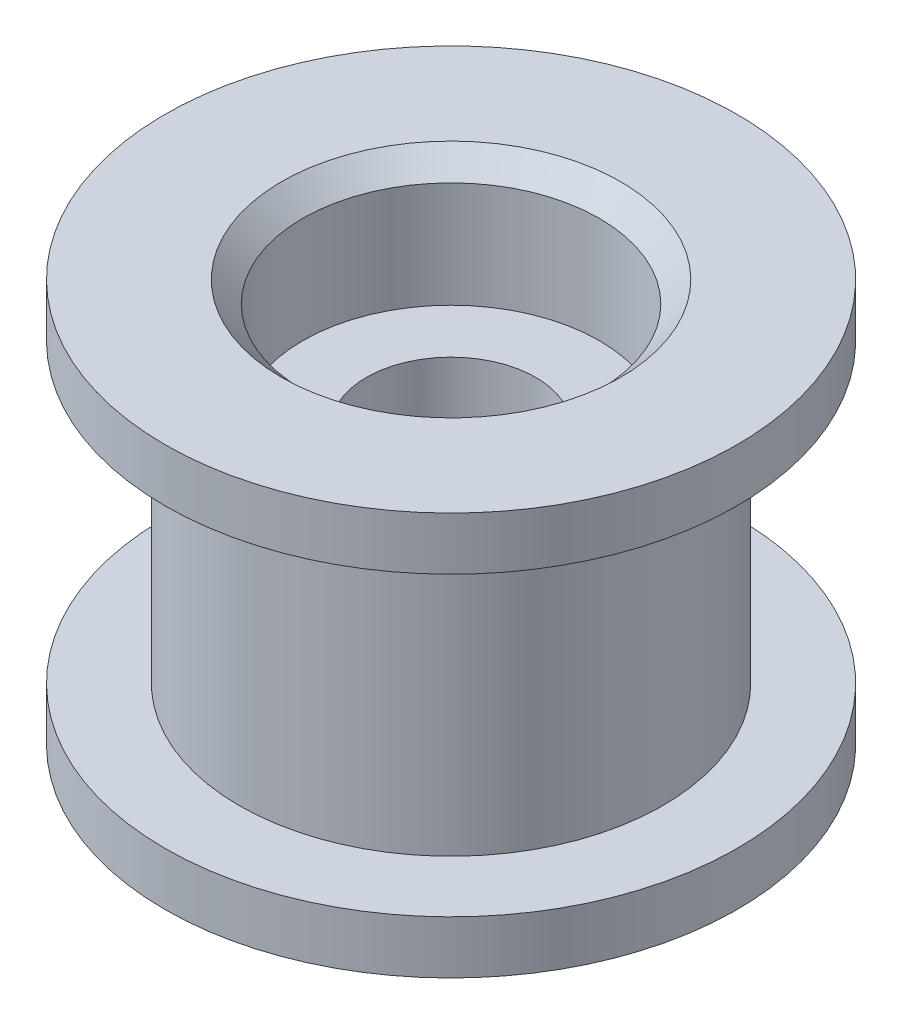
ISO-10303-21;
HEADER;
FILE_DESCRIPTION(('STEP AP214'),'2;1');
FILE_NAME('part.step','',(''),(''),'','','');
FILE_SCHEMA(('AUTOMOTIVE_DESIGN { 1 0 10303 214 1 1 1 1 }'));
ENDSEC;
DATA;
#1=APPLICATION_CONTEXT('core data for automotive mechanical design processes');
#2=APPLICATION_PROTOCOL_DEFINITION('international standard','automotive_design',2000,#1);
#3=PRODUCT_CONTEXT('',#1,'mechanical');
#4=PRODUCT('Part','Part','',(#3));
#5=PRODUCT_RELATED_PRODUCT_CATEGORY('part','',(#4));
#6=PRODUCT_DEFINITION_FORMATION('','',#4);
#7=PRODUCT_DEFINITION_CONTEXT('part definition',#1,'design');
#8=PRODUCT_DEFINITION('design','',#6,#7);
#9=PRODUCT_DEFINITION_SHAPE('','',#8);
#10=(LENGTH_UNIT() NAMED_UNIT(*) SI_UNIT(.MILLI.,.METRE.));
#11=(NAMED_UNIT(*) PLANE_ANGLE_UNIT() SI_UNIT($,.RADIAN.));
#12=(NAMED_UNIT(*) SI_UNIT($,.STERADIAN.) SOLID_ANGLE_UNIT());
#13=UNCERTAINTY_MEASURE_WITH_UNIT(LENGTH_MEASURE(1.E-05),#10,'distance_accuracy_value','');
#14=(GEOMETRIC_REPRESENTATION_CONTEXT(3) GLOBAL_UNCERTAINTY_ASSIGNED_CONTEXT((#13)) GLOBAL_UNIT_ASSIGNED_CONTEXT((#10,
#11,#12)) REPRESENTATION_CONTEXT('',''));
#15=CARTESIAN_POINT('',(0.,0.,0.));
#16=DIRECTION('',(0.,0.,1.));
#17=DIRECTION('',(1.,0.,0.));
#18=AXIS2_PLACEMENT_3D('',#15,#16,#17);
#19=CARTESIAN_POINT('',(0.,7.,0.));
#20=DIRECTION('',(0.,-1.,0.));
#21=DIRECTION('',(0.,0.,-1.));
#22=AXIS2_PLACEMENT_3D('',#19,#20,#21);
#23=CYLINDRICAL_SURFACE('',#22,5.);
#24=CARTESIAN_POINT('',(0.,7.,0.));
#25=DIRECTION('',(0.,1.,0.));
#26=DIRECTION('',(0.,0.,1.));
#27=AXIS2_PLACEMENT_3D('',#24,#25,#26);
#28=CIRCLE('',#27,5.);
#29=CARTESIAN_POINT('',(0.,7.,5.));
#30=VERTEX_POINT('',#29);
#31=EDGE_CURVE('E56',#30,#30,#28,.T.);
#32=ORIENTED_EDGE('',*,*,#31,.F.);
#33=EDGE_LOOP('',(#32));
#34=FACE_BOUND('',#33,.T.);
#35=CARTESIAN_POINT('',(0.,0.,0.));
#36=DIRECTION('',(0.,1.,0.));
#37=DIRECTION('',(0.,0.,1.));
#38=AXIS2_PLACEMENT_3D('',#35,#36,#37);
#39=CIRCLE('',#38,5.);
#40=CARTESIAN_POINT('',(0.,0.,5.));
#41=VERTEX_POINT('',#40);
#42=EDGE_CURVE('E62',#41,#41,#39,.T.);
#43=ORIENTED_EDGE('',*,*,#42,.T.);
#44=EDGE_LOOP('',(#43));
#45=FACE_BOUND('',#44,.T.);
#46=ADVANCED_FACE('F35',(#34,#45),#23,.T.);
#47=CARTESIAN_POINT('',(0.,8.25,0.));
#48=DIRECTION('',(0.,-1.,0.));
#49=DIRECTION('',(0.,0.,-1.));
#50=AXIS2_PLACEMENT_3D('',#47,#48,#49);
#51=CYLINDRICAL_SURFACE('',#50,6.75);
#52=CARTESIAN_POINT('',(0.,8.25,0.));
#53=DIRECTION('',(0.,1.,0.));
#54=DIRECTION('',(0.,0.,1.));
#55=AXIS2_PLACEMENT_3D('',#52,#53,#54);
#56=CIRCLE('',#55,6.75);
#57=CARTESIAN_POINT('',(0.,8.25,6.75));
#58=VERTEX_POINT('',#57);
#59=EDGE_CURVE('E69',#58,#58,#56,.T.);
#60=ORIENTED_EDGE('',*,*,#59,.F.);
#61=EDGE_LOOP('',(#60));
#62=FACE_BOUND('',#61,.T.);
#63=CARTESIAN_POINT('',(0.,7.,0.));
#64=DIRECTION('',(0.,1.,0.));
#65=DIRECTION('',(0.,0.,1.));
#66=AXIS2_PLACEMENT_3D('',#63,#64,#65);
#67=CIRCLE('',#66,6.75);
#68=CARTESIAN_POINT('',(0.,7.,6.75));
#69=VERTEX_POINT('',#68);
#70=EDGE_CURVE('E65',#69,#69,#67,.T.);
#71=ORIENTED_EDGE('',*,*,#70,.T.);
#72=EDGE_LOOP('',(#71));
#73=FACE_BOUND('',#72,.T.);
#74=ADVANCED_FACE('F107',(#62,#73),#51,.T.);
#75=CARTESIAN_POINT('',(0.,8.25,0.));
#76=DIRECTION('',(0.,1.,0.));
#77=DIRECTION('',(0.,0.,1.));
#78=AXIS2_PLACEMENT_3D('',#75,#76,#77);
#79=PLANE('',#78);
#80=CARTESIAN_POINT('',(0.,8.25,0.));
#81=DIRECTION('',(0.,1.,0.));
#82=DIRECTION('',(0.,0.,1.));
#83=AXIS2_PLACEMENT_3D('',#80,#81,#82);
#84=CIRCLE('',#83,4.);
#85=CARTESIAN_POINT('',(0.,8.25,4.));
#86=VERTEX_POINT('',#85);
#87=EDGE_CURVE('E47',#86,#86,#84,.F.);
#88=ORIENTED_EDGE('',*,*,#87,.T.);
#89=EDGE_LOOP('',(#88));
#90=FACE_BOUND('',#89,.T.);
#91=ORIENTED_EDGE('',*,*,#59,.T.);
#92=EDGE_LOOP('',(#91));
#93=FACE_BOUND('',#92,.T.);
#94=ADVANCED_FACE('F113',(#90,#93),#79,.T.);
#95=CARTESIAN_POINT('',(0.,7.,0.));
#96=DIRECTION('',(0.,1.,0.));
#97=DIRECTION('',(0.,0.,1.));
#98=AXIS2_PLACEMENT_3D('',#95,#96,#97);
#99=PLANE('',#98);
#100=ORIENTED_EDGE('',*,*,#31,.T.);
#101=EDGE_LOOP('',(#100));
#102=FACE_BOUND('',#101,.T.);
#103=ORIENTED_EDGE('',*,*,#70,.F.);
#104=EDGE_LOOP('',(#103));
#105=FACE_BOUND('',#104,.T.);
#106=ADVANCED_FACE('F138',(#102,#105),#99,.F.);
#107=CARTESIAN_POINT('',(0.,-1.25,0.));
#108=DIRECTION('',(0.,1.,0.));
#109=DIRECTION('',(0.,0.,1.));
#110=AXIS2_PLACEMENT_3D('',#107,#108,#109);
#111=CYLINDRICAL_SURFACE('',#110,6.75);
#112=CARTESIAN_POINT('',(0.,-1.25,0.));
#113=DIRECTION('',(0.,1.,0.));
#114=DIRECTION('',(0.,0.,1.));
#115=AXIS2_PLACEMENT_3D('',#112,#113,#114);
#116=CIRCLE('',#115,6.75);
#117=CARTESIAN_POINT('',(0.,-1.25,6.75));
#118=VERTEX_POINT('',#117);
#119=EDGE_CURVE('E66',#118,#118,#116,.T.);
#120=ORIENTED_EDGE('',*,*,#119,.T.);
#121=EDGE_LOOP('',(#120));
#122=FACE_BOUND('',#121,.T.);
#123=CARTESIAN_POINT('',(0.,0.,0.));
#124=DIRECTION('',(0.,1.,0.));
#125=DIRECTION('',(0.,0.,1.));
#126=AXIS2_PLACEMENT_3D('',#123,#124,#125);
#127=CIRCLE('',#126,6.75);
#128=CARTESIAN_POINT('',(0.,0.,6.75));
#129=VERTEX_POINT('',#128);
#130=EDGE_CURVE('E74',#129,#129,#127,.T.);
#131=ORIENTED_EDGE('',*,*,#130,.F.);
#132=EDGE_LOOP('',(#131));
#133=FACE_BOUND('',#132,.T.);
#134=ADVANCED_FACE('F145',(#122,#133),#111,.T.);
#135=CARTESIAN_POINT('',(0.,-1.25,0.));
#136=DIRECTION('',(0.,1.,0.));
#137=DIRECTION('',(0.,0.,1.));
#138=AXIS2_PLACEMENT_3D('',#135,#136,#137);
#139=PLANE('',#138);
#140=CARTESIAN_POINT('',(0.,-1.25,0.));
#141=DIRECTION('',(0.,1.,0.));
#142=DIRECTION('',(0.,0.,1.));
#143=AXIS2_PLACEMENT_3D('',#140,#141,#142);
#144=CIRCLE('',#143,4.);
#145=CARTESIAN_POINT('',(0.,-1.25,4.));
#146=VERTEX_POINT('',#145);
#147=EDGE_CURVE('E10',#146,#146,#144,.T.);
#148=ORIENTED_EDGE('',*,*,#147,.T.);
#149=EDGE_LOOP('',(#148));
#150=FACE_BOUND('',#149,.T.);
#151=ORIENTED_EDGE('',*,*,#119,.F.);
#152=EDGE_LOOP('',(#151));
#153=FACE_BOUND('',#152,.T.);
#154=ADVANCED_FACE('F150',(#150,#153),#139,.F.);
#155=CARTESIAN_POINT('',(0.,0.,0.));
#156=DIRECTION('',(0.,1.,0.));
#157=DIRECTION('',(0.,0.,1.));
#158=AXIS2_PLACEMENT_3D('',#155,#156,#157);
#159=PLANE('',#158);
#160=ORIENTED_EDGE('',*,*,#42,.F.);
#161=EDGE_LOOP('',(#160));
#162=FACE_BOUND('',#161,.T.);
#163=ORIENTED_EDGE('',*,*,#130,.T.);
#164=EDGE_LOOP('',(#163));
#165=FACE_BOUND('',#164,.T.);
#166=ADVANCED_FACE('F154',(#162,#165),#159,.T.);
#167=CARTESIAN_POINT('',(0.,1.75,0.));
#168=DIRECTION('',(0.,-1.,0.));
#169=DIRECTION('',(0.,0.,-1.));
#170=AXIS2_PLACEMENT_3D('',#167,#168,#169);
#171=CYLINDRICAL_SURFACE('',#170,3.5);
#172=CARTESIAN_POINT('',(0.,-0.750000000000002,0.));
#173=DIRECTION('',(0.,1.,0.));
#174=DIRECTION('',(0.,0.,1.));
#175=AXIS2_PLACEMENT_3D('',#172,#173,#174);
#176=CIRCLE('',#175,3.5);
#177=CARTESIAN_POINT('',(0.,-0.750000000000002,3.5));
#178=VERTEX_POINT('',#177);
#179=EDGE_CURVE('E43',#178,#178,#176,.F.);
#180=ORIENTED_EDGE('',*,*,#179,.T.);
#181=EDGE_LOOP('',(#180));
#182=FACE_BOUND('',#181,.T.);
#183=CARTESIAN_POINT('',(0.,1.75,0.));
#184=DIRECTION('',(0.,-1.,0.));
#185=DIRECTION('',(0.,0.,-1.));
#186=AXIS2_PLACEMENT_3D('',#183,#184,#185);
#187=CIRCLE('',#186,3.5);
#188=CARTESIAN_POINT('',(0.,1.75,-3.5));
#189=VERTEX_POINT('',#188);
#190=EDGE_CURVE('E77',#189,#189,#187,.T.);
#191=ORIENTED_EDGE('',*,*,#190,.F.);
#192=EDGE_LOOP('',(#191));
#193=FACE_BOUND('',#192,.T.);
#194=ADVANCED_FACE('F103',(#182,#193),#171,.F.);
#195=CARTESIAN_POINT('',(0.,1.75,0.));
#196=DIRECTION('',(0.,-1.,0.));
#197=DIRECTION('',(0.,0.,-1.));
#198=AXIS2_PLACEMENT_3D('',#195,#196,#197);
#199=PLANE('',#198);
#200=CARTESIAN_POINT('',(0.,1.75,0.));
#201=DIRECTION('',(0.,-1.,0.));
#202=DIRECTION('',(0.,0.,-1.));
#203=AXIS2_PLACEMENT_3D('',#200,#201,#202);
#204=CIRCLE('',#203,2.);
#205=CARTESIAN_POINT('',(0.,1.75,-2.));
#206=VERTEX_POINT('',#205);
#207=EDGE_CURVE('E57',#206,#206,#204,.T.);
#208=ORIENTED_EDGE('',*,*,#207,.F.);
#209=EDGE_LOOP('',(#208));
#210=FACE_BOUND('',#209,.T.);
#211=ORIENTED_EDGE('',*,*,#190,.T.);
#212=EDGE_LOOP('',(#211));
#213=FACE_BOUND('',#212,.T.);
#214=ADVANCED_FACE('F97',(#210,#213),#199,.T.);
#215=CARTESIAN_POINT('',(0.,5.25,0.));
#216=DIRECTION('',(0.,1.,0.));
#217=DIRECTION('',(0.,0.,1.));
#218=AXIS2_PLACEMENT_3D('',#215,#216,#217);
#219=CYLINDRICAL_SURFACE('',#218,3.5);
#220=CARTESIAN_POINT('',(0.,7.75,0.));
#221=DIRECTION('',(0.,1.,0.));
#222=DIRECTION('',(0.,0.,1.));
#223=AXIS2_PLACEMENT_3D('',#220,#221,#222);
#224=CIRCLE('',#223,3.5);
#225=CARTESIAN_POINT('',(0.,7.75,3.5));
#226=VERTEX_POINT('',#225);
#227=EDGE_CURVE('E51',#226,#226,#224,.T.);
#228=ORIENTED_EDGE('',*,*,#227,.T.);
#229=EDGE_LOOP('',(#228));
#230=FACE_BOUND('',#229,.T.);
#231=CARTESIAN_POINT('',(0.,5.25,0.));
#232=DIRECTION('',(0.,1.,0.));
#233=DIRECTION('',(0.,0.,1.));
#234=AXIS2_PLACEMENT_3D('',#231,#232,#233);
#235=CIRCLE('',#234,3.5);
#236=CARTESIAN_POINT('',(0.,5.25,3.5));
#237=VERTEX_POINT('',#236);
#238=EDGE_CURVE('E60',#237,#237,#235,.T.);
#239=ORIENTED_EDGE('',*,*,#238,.F.);
#240=EDGE_LOOP('',(#239));
#241=FACE_BOUND('',#240,.T.);
#242=ADVANCED_FACE('F92',(#230,#241),#219,.F.);
#243=CARTESIAN_POINT('',(0.,5.25,0.));
#244=DIRECTION('',(0.,1.,0.));
#245=DIRECTION('',(0.,0.,1.));
#246=AXIS2_PLACEMENT_3D('',#243,#244,#245);
#247=PLANE('',#246);
#248=CARTESIAN_POINT('',(0.,5.25,0.));
#249=DIRECTION('',(0.,1.,0.));
#250=DIRECTION('',(0.,0.,1.));
#251=AXIS2_PLACEMENT_3D('',#248,#249,#250);
#252=CIRCLE('',#251,2.);
#253=CARTESIAN_POINT('',(0.,5.25,2.));
#254=VERTEX_POINT('',#253);
#255=EDGE_CURVE('E61',#254,#254,#252,.T.);
#256=ORIENTED_EDGE('',*,*,#255,.F.);
#257=EDGE_LOOP('',(#256));
#258=FACE_BOUND('',#257,.T.);
#259=ORIENTED_EDGE('',*,*,#238,.T.);
#260=EDGE_LOOP('',(#259));
#261=FACE_BOUND('',#260,.T.);
#262=ADVANCED_FACE('F89',(#258,#261),#247,.T.);
#263=CARTESIAN_POINT('',(0.,-1.25,0.));
#264=DIRECTION('',(0.,1.,0.));
#265=DIRECTION('',(0.,0.,1.));
#266=AXIS2_PLACEMENT_3D('',#263,#264,#265);
#267=CYLINDRICAL_SURFACE('',#266,2.);
#268=ORIENTED_EDGE('',*,*,#207,.T.);
#269=EDGE_LOOP('',(#268));
#270=FACE_BOUND('',#269,.T.);
#271=ORIENTED_EDGE('',*,*,#255,.T.);
#272=EDGE_LOOP('',(#271));
#273=FACE_BOUND('',#272,.T.);
#274=ADVANCED_FACE('F87',(#270,#273),#267,.F.);
#275=CARTESIAN_POINT('',(0.,7.75,0.));
#276=DIRECTION('',(0.,1.,0.));
#277=DIRECTION('',(0.,0.,1.));
#278=AXIS2_PLACEMENT_3D('',#275,#276,#277);
#279=CONICAL_SURFACE('',#278,3.5,0.785398163397451);
#280=ORIENTED_EDGE('',*,*,#87,.F.);
#281=EDGE_LOOP('',(#280));
#282=FACE_BOUND('',#281,.T.);
#283=ORIENTED_EDGE('',*,*,#227,.F.);
#284=EDGE_LOOP('',(#283));
#285=FACE_BOUND('',#284,.T.);
#286=ADVANCED_FACE('F120',(#282,#285),#279,.F.);
#287=CARTESIAN_POINT('',(0.,-0.750000000000002,0.));
#288=DIRECTION('',(0.,-1.,0.));
#289=DIRECTION('',(0.,0.,-1.));
#290=AXIS2_PLACEMENT_3D('',#287,#288,#289);
#291=CONICAL_SURFACE('',#290,3.5,0.785398163397447);
#292=ORIENTED_EDGE('',*,*,#147,.F.);
#293=EDGE_LOOP('',(#292));
#294=FACE_BOUND('',#293,.T.);
#295=ORIENTED_EDGE('',*,*,#179,.F.);
#296=EDGE_LOOP('',(#295));
#297=FACE_BOUND('',#296,.T.);
#298=ADVANCED_FACE('F38',(#294,#297),#291,.F.);
#299=CLOSED_SHELL('',(#46,#74,#94,#106,#134,#154,#166,#194,#214,#242,#262,#274,#286,#298));
#300=MANIFOLD_SOLID_BREP('B2',#299);
#301=ADVANCED_BREP_SHAPE_REPRESENTATION('',(#18,#300),#14);
#302=SHAPE_DEFINITION_REPRESENTATION(#9,#301);
ENDSEC;
END-ISO-10303-21;
